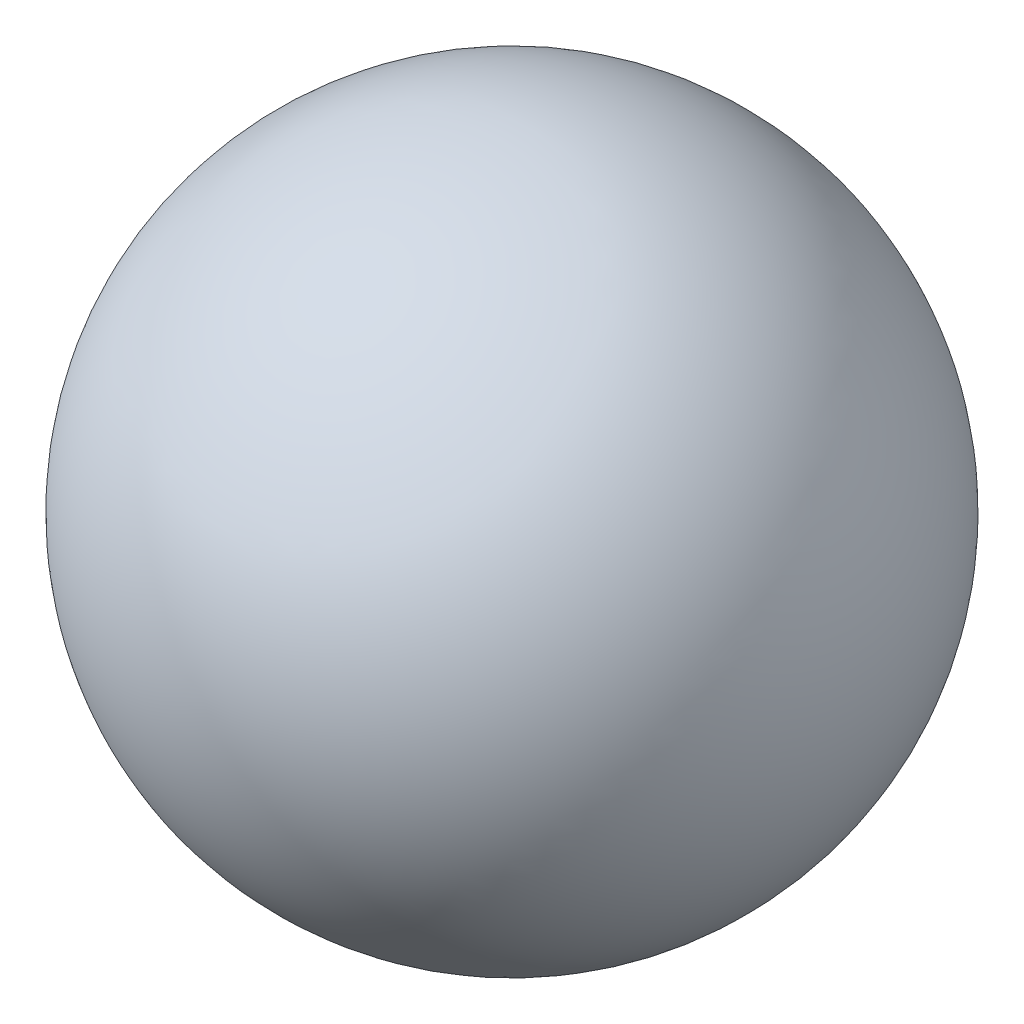
ISO-10303-21;
HEADER;
FILE_DESCRIPTION(('STEP AP214'),'2;1');
FILE_NAME('part.step','',(''),(''),'','','');
FILE_SCHEMA(('AUTOMOTIVE_DESIGN { 1 0 10303 214 1 1 1 1 }'));
ENDSEC;
DATA;
#1=APPLICATION_CONTEXT('core data for automotive mechanical design processes');
#2=APPLICATION_PROTOCOL_DEFINITION('international standard','automotive_design',2000,#1);
#3=PRODUCT_CONTEXT('',#1,'mechanical');
#4=PRODUCT('Part','Part','',(#3));
#5=PRODUCT_RELATED_PRODUCT_CATEGORY('part','',(#4));
#6=PRODUCT_DEFINITION_FORMATION('','',#4);
#7=PRODUCT_DEFINITION_CONTEXT('part definition',#1,'design');
#8=PRODUCT_DEFINITION('design','',#6,#7);
#9=PRODUCT_DEFINITION_SHAPE('','',#8);
#10=(LENGTH_UNIT() NAMED_UNIT(*) SI_UNIT(.MILLI.,.METRE.));
#11=(NAMED_UNIT(*) PLANE_ANGLE_UNIT() SI_UNIT($,.RADIAN.));
#12=(NAMED_UNIT(*) SI_UNIT($,.STERADIAN.) SOLID_ANGLE_UNIT());
#13=UNCERTAINTY_MEASURE_WITH_UNIT(LENGTH_MEASURE(1.E-05),#10,'distance_accuracy_value','');
#14=(GEOMETRIC_REPRESENTATION_CONTEXT(3) GLOBAL_UNCERTAINTY_ASSIGNED_CONTEXT((#13)) GLOBAL_UNIT_ASSIGNED_CONTEXT((#10,
#11,#12)) REPRESENTATION_CONTEXT('',''));
#15=CARTESIAN_POINT('',(0.,0.,0.));
#16=DIRECTION('',(0.,0.,1.));
#17=DIRECTION('',(1.,0.,0.));
#18=AXIS2_PLACEMENT_3D('',#15,#16,#17);
#19=CARTESIAN_POINT('',(0.,0.,0.));
#20=DIRECTION('',(0.,0.,-1.));
#21=DIRECTION('',(1.,0.,0.));
#22=AXIS2_PLACEMENT_3D('',#19,#20,#21);
#23=SPHERICAL_SURFACE('',#22,1.5875);
#24=CARTESIAN_POINT('',(0.,0.,-1.5875));
#25=VERTEX_POINT('',#24);
#26=VERTEX_LOOP('',#25);
#27=FACE_BOUND('',#26,.T.);
#28=ADVANCED_FACE('F27',(#27),#23,.T.);
#29=CLOSED_SHELL('',(#28));
#30=MANIFOLD_SOLID_BREP('B2',#29);
#31=ADVANCED_BREP_SHAPE_REPRESENTATION('',(#18,#30),#14);
#32=SHAPE_DEFINITION_REPRESENTATION(#9,#31);
ENDSEC;
END-ISO-10303-21;
